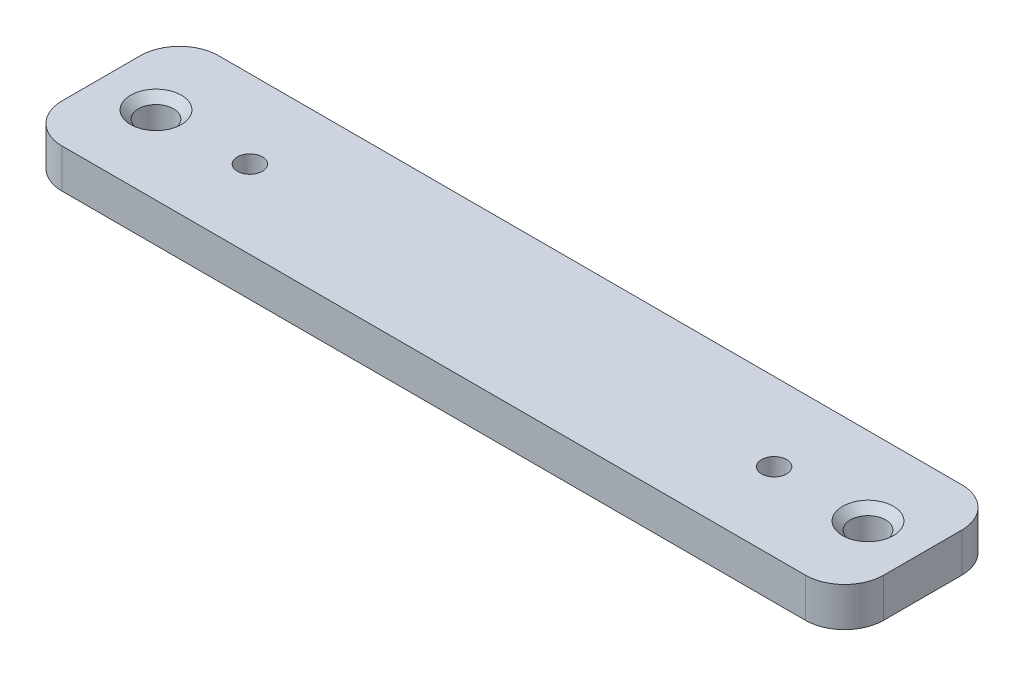
ISO-10303-21;
HEADER;
FILE_DESCRIPTION(('STEP AP214'),'2;1');
FILE_NAME('part.step','',(''),(''),'','','');
FILE_SCHEMA(('AUTOMOTIVE_DESIGN { 1 0 10303 214 1 1 1 1 }'));
ENDSEC;
DATA;
#1=APPLICATION_CONTEXT('core data for automotive mechanical design processes');
#2=APPLICATION_PROTOCOL_DEFINITION('international standard','automotive_design',2000,#1);
#3=PRODUCT_CONTEXT('',#1,'mechanical');
#4=PRODUCT('Part','Part','',(#3));
#5=PRODUCT_RELATED_PRODUCT_CATEGORY('part','',(#4));
#6=PRODUCT_DEFINITION_FORMATION('','',#4);
#7=PRODUCT_DEFINITION_CONTEXT('part definition',#1,'design');
#8=PRODUCT_DEFINITION('design','',#6,#7);
#9=PRODUCT_DEFINITION_SHAPE('','',#8);
#10=(LENGTH_UNIT() NAMED_UNIT(*) SI_UNIT(.MILLI.,.METRE.));
#11=(NAMED_UNIT(*) PLANE_ANGLE_UNIT() SI_UNIT($,.RADIAN.));
#12=(NAMED_UNIT(*) SI_UNIT($,.STERADIAN.) SOLID_ANGLE_UNIT());
#13=UNCERTAINTY_MEASURE_WITH_UNIT(LENGTH_MEASURE(1.E-05),#10,'distance_accuracy_value','');
#14=(GEOMETRIC_REPRESENTATION_CONTEXT(3) GLOBAL_UNCERTAINTY_ASSIGNED_CONTEXT((#13)) GLOBAL_UNIT_ASSIGNED_CONTEXT((#10,
#11,#12)) REPRESENTATION_CONTEXT('',''));
#15=CARTESIAN_POINT('',(0.,0.,0.));
#16=DIRECTION('',(0.,0.,1.));
#17=DIRECTION('',(1.,0.,0.));
#18=AXIS2_PLACEMENT_3D('',#15,#16,#17);
#19=CARTESIAN_POINT('',(0.,5.,0.));
#20=DIRECTION('',(0.,-1.,0.));
#21=DIRECTION('',(0.,0.,-1.));
#22=AXIS2_PLACEMENT_3D('',#19,#20,#21);
#23=PLANE('',#22);
#24=CARTESIAN_POINT('',(98.,5.,-10.));
#25=DIRECTION('',(0.,-1.,0.));
#26=DIRECTION('',(0.,0.,-1.));
#27=AXIS2_PLACEMENT_3D('',#24,#25,#26);
#28=CIRCLE('',#27,3.25);
#29=CARTESIAN_POINT('',(98.,5.,-13.25));
#30=VERTEX_POINT('',#29);
#31=EDGE_CURVE('E177',#30,#30,#28,.T.);
#32=ORIENTED_EDGE('',*,*,#31,.T.);
#33=EDGE_LOOP('',(#32));
#34=FACE_BOUND('',#33,.T.);
#35=CARTESIAN_POINT('',(7.,5.,-10.));
#36=DIRECTION('',(0.,-1.,0.));
#37=DIRECTION('',(0.,0.,-1.));
#38=AXIS2_PLACEMENT_3D('',#35,#36,#37);
#39=CIRCLE('',#38,3.25);
#40=CARTESIAN_POINT('',(7.,5.,-13.25));
#41=VERTEX_POINT('',#40);
#42=EDGE_CURVE('E174',#41,#41,#39,.T.);
#43=ORIENTED_EDGE('',*,*,#42,.T.);
#44=EDGE_LOOP('',(#43));
#45=FACE_BOUND('',#44,.T.);
#46=DIRECTION('',(-1.,0.,0.));
#47=VECTOR('',#46,1.);
#48=CARTESIAN_POINT('',(0.,5.,-20.));
#49=LINE('',#48,#47);
#50=CARTESIAN_POINT('',(100.,5.,-20.));
#51=VERTEX_POINT('',#50);
#52=CARTESIAN_POINT('',(5.,5.,-20.));
#53=VERTEX_POINT('',#52);
#54=EDGE_CURVE('E141',#51,#53,#49,.T.);
#55=ORIENTED_EDGE('',*,*,#54,.T.);
#56=CARTESIAN_POINT('',(5.,5.,-15.));
#57=DIRECTION('',(0.,-1.,0.));
#58=DIRECTION('',(0.,0.,-1.));
#59=AXIS2_PLACEMENT_3D('',#56,#57,#58);
#60=CIRCLE('',#59,5.);
#61=CARTESIAN_POINT('',(0.,5.,-15.));
#62=VERTEX_POINT('',#61);
#63=EDGE_CURVE('E160',#53,#62,#60,.F.);
#64=ORIENTED_EDGE('',*,*,#63,.T.);
#65=DIRECTION('',(0.,0.,1.));
#66=VECTOR('',#65,1.);
#67=CARTESIAN_POINT('',(0.,5.,0.));
#68=LINE('',#67,#66);
#69=CARTESIAN_POINT('',(0.,5.,-5.));
#70=VERTEX_POINT('',#69);
#71=EDGE_CURVE('E124',#62,#70,#68,.T.);
#72=ORIENTED_EDGE('',*,*,#71,.T.);
#73=CARTESIAN_POINT('',(5.,5.,-5.));
#74=DIRECTION('',(0.,-1.,0.));
#75=DIRECTION('',(0.,0.,-1.));
#76=AXIS2_PLACEMENT_3D('',#73,#74,#75);
#77=CIRCLE('',#76,5.);
#78=CARTESIAN_POINT('',(5.,5.,0.));
#79=VERTEX_POINT('',#78);
#80=EDGE_CURVE('E158',#70,#79,#77,.F.);
#81=ORIENTED_EDGE('',*,*,#80,.T.);
#82=DIRECTION('',(1.,0.,0.));
#83=VECTOR('',#82,1.);
#84=CARTESIAN_POINT('',(0.,5.,0.));
#85=LINE('',#84,#83);
#86=CARTESIAN_POINT('',(100.,5.,0.));
#87=VERTEX_POINT('',#86);
#88=EDGE_CURVE('E217',#79,#87,#85,.T.);
#89=ORIENTED_EDGE('',*,*,#88,.T.);
#90=CARTESIAN_POINT('',(100.,5.,-5.));
#91=DIRECTION('',(0.,-1.,0.));
#92=DIRECTION('',(0.,0.,-1.));
#93=AXIS2_PLACEMENT_3D('',#90,#91,#92);
#94=CIRCLE('',#93,5.);
#95=CARTESIAN_POINT('',(105.,5.,-5.));
#96=VERTEX_POINT('',#95);
#97=EDGE_CURVE('E59',#87,#96,#94,.F.);
#98=ORIENTED_EDGE('',*,*,#97,.T.);
#99=DIRECTION('',(0.,0.,-1.));
#100=VECTOR('',#99,1.);
#101=CARTESIAN_POINT('',(105.,5.,0.));
#102=LINE('',#101,#100);
#103=CARTESIAN_POINT('',(105.,5.,-15.));
#104=VERTEX_POINT('',#103);
#105=EDGE_CURVE('E218',#96,#104,#102,.T.);
#106=ORIENTED_EDGE('',*,*,#105,.T.);
#107=CARTESIAN_POINT('',(100.,5.,-15.));
#108=DIRECTION('',(0.,-1.,0.));
#109=DIRECTION('',(0.,0.,-1.));
#110=AXIS2_PLACEMENT_3D('',#107,#108,#109);
#111=CIRCLE('',#110,5.);
#112=EDGE_CURVE('E156',#104,#51,#111,.F.);
#113=ORIENTED_EDGE('',*,*,#112,.T.);
#114=EDGE_LOOP('',(#55,#64,#72,#81,#89,#98,#106,#113));
#115=FACE_BOUND('',#114,.T.);
#116=CARTESIAN_POINT('',(19.,5.,-10.));
#117=DIRECTION('',(0.,1.,0.));
#118=DIRECTION('',(0.,0.,1.));
#119=AXIS2_PLACEMENT_3D('',#116,#117,#118);
#120=CIRCLE('',#119,1.6);
#121=CARTESIAN_POINT('',(19.,5.,-8.4));
#122=VERTEX_POINT('',#121);
#123=EDGE_CURVE('E132',#122,#122,#120,.T.);
#124=ORIENTED_EDGE('',*,*,#123,.F.);
#125=EDGE_LOOP('',(#124));
#126=FACE_BOUND('',#125,.T.);
#127=CARTESIAN_POINT('',(86.,5.,-10.));
#128=DIRECTION('',(0.,1.,0.));
#129=DIRECTION('',(0.,0.,1.));
#130=AXIS2_PLACEMENT_3D('',#127,#128,#129);
#131=CIRCLE('',#130,1.6);
#132=CARTESIAN_POINT('',(86.,5.,-8.4));
#133=VERTEX_POINT('',#132);
#134=EDGE_CURVE('E138',#133,#133,#131,.T.);
#135=ORIENTED_EDGE('',*,*,#134,.F.);
#136=EDGE_LOOP('',(#135));
#137=FACE_BOUND('',#136,.T.);
#138=ADVANCED_FACE('F37',(#34,#45,#115,#126,#137),#23,.F.);
#139=CARTESIAN_POINT('',(0.,0.,0.));
#140=DIRECTION('',(0.,-1.,0.));
#141=DIRECTION('',(0.,0.,-1.));
#142=AXIS2_PLACEMENT_3D('',#139,#140,#141);
#143=PLANE('',#142);
#144=CARTESIAN_POINT('',(86.,0.,-10.));
#145=DIRECTION('',(0.,-1.,0.));
#146=DIRECTION('',(0.,0.,-1.));
#147=AXIS2_PLACEMENT_3D('',#144,#145,#146);
#148=CIRCLE('',#147,2.60000000000002);
#149=CARTESIAN_POINT('',(86.,0.,-12.6));
#150=VERTEX_POINT('',#149);
#151=EDGE_CURVE('E186',#150,#150,#148,.F.);
#152=ORIENTED_EDGE('',*,*,#151,.T.);
#153=EDGE_LOOP('',(#152));
#154=FACE_BOUND('',#153,.T.);
#155=CARTESIAN_POINT('',(19.,0.,-10.));
#156=DIRECTION('',(0.,-1.,0.));
#157=DIRECTION('',(0.,0.,-1.));
#158=AXIS2_PLACEMENT_3D('',#155,#156,#157);
#159=CIRCLE('',#158,2.60000000000002);
#160=CARTESIAN_POINT('',(19.,0.,-12.6));
#161=VERTEX_POINT('',#160);
#162=EDGE_CURVE('E183',#161,#161,#159,.F.);
#163=ORIENTED_EDGE('',*,*,#162,.T.);
#164=EDGE_LOOP('',(#163));
#165=FACE_BOUND('',#164,.T.);
#166=CARTESIAN_POINT('',(7.,0.,-10.));
#167=DIRECTION('',(0.,1.,0.));
#168=DIRECTION('',(0.,0.,1.));
#169=AXIS2_PLACEMENT_3D('',#166,#167,#168);
#170=CIRCLE('',#169,2.25);
#171=CARTESIAN_POINT('',(7.,0.,-7.75));
#172=VERTEX_POINT('',#171);
#173=EDGE_CURVE('E207',#172,#172,#170,.T.);
#174=ORIENTED_EDGE('',*,*,#173,.T.);
#175=EDGE_LOOP('',(#174));
#176=FACE_BOUND('',#175,.T.);
#177=DIRECTION('',(0.,0.,1.));
#178=VECTOR('',#177,1.);
#179=CARTESIAN_POINT('',(0.,0.,0.));
#180=LINE('',#179,#178);
#181=CARTESIAN_POINT('',(0.,0.,-15.));
#182=VERTEX_POINT('',#181);
#183=CARTESIAN_POINT('',(0.,0.,-5.));
#184=VERTEX_POINT('',#183);
#185=EDGE_CURVE('E121',#182,#184,#180,.T.);
#186=ORIENTED_EDGE('',*,*,#185,.F.);
#187=CARTESIAN_POINT('',(5.,0.,-15.));
#188=DIRECTION('',(0.,-1.,0.));
#189=DIRECTION('',(0.,0.,-1.));
#190=AXIS2_PLACEMENT_3D('',#187,#188,#189);
#191=CIRCLE('',#190,5.);
#192=CARTESIAN_POINT('',(5.,0.,-20.));
#193=VERTEX_POINT('',#192);
#194=EDGE_CURVE('E104',#182,#193,#191,.T.);
#195=ORIENTED_EDGE('',*,*,#194,.T.);
#196=DIRECTION('',(-1.,0.,0.));
#197=VECTOR('',#196,1.);
#198=CARTESIAN_POINT('',(0.,0.,-20.));
#199=LINE('',#198,#197);
#200=CARTESIAN_POINT('',(100.,0.,-20.));
#201=VERTEX_POINT('',#200);
#202=EDGE_CURVE('E145',#201,#193,#199,.T.);
#203=ORIENTED_EDGE('',*,*,#202,.F.);
#204=CARTESIAN_POINT('',(100.,0.,-15.));
#205=DIRECTION('',(0.,-1.,0.));
#206=DIRECTION('',(0.,0.,-1.));
#207=AXIS2_PLACEMENT_3D('',#204,#205,#206);
#208=CIRCLE('',#207,5.);
#209=CARTESIAN_POINT('',(105.,0.,-15.));
#210=VERTEX_POINT('',#209);
#211=EDGE_CURVE('E149',#201,#210,#208,.T.);
#212=ORIENTED_EDGE('',*,*,#211,.T.);
#213=DIRECTION('',(0.,0.,-1.));
#214=VECTOR('',#213,1.);
#215=CARTESIAN_POINT('',(105.,0.,0.));
#216=LINE('',#215,#214);
#217=CARTESIAN_POINT('',(105.,0.,-5.));
#218=VERTEX_POINT('',#217);
#219=EDGE_CURVE('E135',#218,#210,#216,.T.);
#220=ORIENTED_EDGE('',*,*,#219,.F.);
#221=CARTESIAN_POINT('',(100.,0.,-5.));
#222=DIRECTION('',(0.,-1.,0.));
#223=DIRECTION('',(0.,0.,-1.));
#224=AXIS2_PLACEMENT_3D('',#221,#222,#223);
#225=CIRCLE('',#224,5.);
#226=CARTESIAN_POINT('',(100.,0.,0.));
#227=VERTEX_POINT('',#226);
#228=EDGE_CURVE('E125',#218,#227,#225,.T.);
#229=ORIENTED_EDGE('',*,*,#228,.T.);
#230=DIRECTION('',(1.,0.,0.));
#231=VECTOR('',#230,1.);
#232=CARTESIAN_POINT('',(0.,0.,0.));
#233=LINE('',#232,#231);
#234=CARTESIAN_POINT('',(5.,0.,0.));
#235=VERTEX_POINT('',#234);
#236=EDGE_CURVE('E131',#235,#227,#233,.T.);
#237=ORIENTED_EDGE('',*,*,#236,.F.);
#238=CARTESIAN_POINT('',(5.,0.,-5.));
#239=DIRECTION('',(0.,-1.,0.));
#240=DIRECTION('',(0.,0.,-1.));
#241=AXIS2_PLACEMENT_3D('',#238,#239,#240);
#242=CIRCLE('',#241,5.);
#243=EDGE_CURVE('E115',#235,#184,#242,.T.);
#244=ORIENTED_EDGE('',*,*,#243,.T.);
#245=EDGE_LOOP('',(#186,#195,#203,#212,#220,#229,#237,#244));
#246=FACE_BOUND('',#245,.T.);
#247=CARTESIAN_POINT('',(98.,0.,-10.));
#248=DIRECTION('',(0.,1.,0.));
#249=DIRECTION('',(0.,0.,1.));
#250=AXIS2_PLACEMENT_3D('',#247,#248,#249);
#251=CIRCLE('',#250,2.25);
#252=CARTESIAN_POINT('',(98.,0.,-7.75));
#253=VERTEX_POINT('',#252);
#254=EDGE_CURVE('E209',#253,#253,#251,.T.);
#255=ORIENTED_EDGE('',*,*,#254,.T.);
#256=EDGE_LOOP('',(#255));
#257=FACE_BOUND('',#256,.T.);
#258=ADVANCED_FACE('F128',(#154,#165,#176,#246,#257),#143,.T.);
#259=CARTESIAN_POINT('',(0.,5.,0.));
#260=DIRECTION('',(1.,0.,0.));
#261=DIRECTION('',(0.,0.,-1.));
#262=AXIS2_PLACEMENT_3D('',#259,#260,#261);
#263=PLANE('',#262);
#264=ORIENTED_EDGE('',*,*,#71,.F.);
#265=DIRECTION('',(0.,-1.,0.));
#266=VECTOR('',#265,1.);
#267=CARTESIAN_POINT('',(0.,5.,-15.));
#268=LINE('',#267,#266);
#269=EDGE_CURVE('E108',#62,#182,#268,.T.);
#270=ORIENTED_EDGE('',*,*,#269,.T.);
#271=ORIENTED_EDGE('',*,*,#185,.T.);
#272=DIRECTION('',(0.,-1.,0.));
#273=VECTOR('',#272,1.);
#274=CARTESIAN_POINT('',(0.,5.,-5.));
#275=LINE('',#274,#273);
#276=EDGE_CURVE('E126',#184,#70,#275,.F.);
#277=ORIENTED_EDGE('',*,*,#276,.T.);
#278=EDGE_LOOP('',(#264,#270,#271,#277));
#279=FACE_BOUND('',#278,.T.);
#280=ADVANCED_FACE('F120',(#279),#263,.F.);
#281=CARTESIAN_POINT('',(0.,5.,0.));
#282=DIRECTION('',(0.,0.,-1.));
#283=DIRECTION('',(-1.,0.,0.));
#284=AXIS2_PLACEMENT_3D('',#281,#282,#283);
#285=PLANE('',#284);
#286=ORIENTED_EDGE('',*,*,#88,.F.);
#287=DIRECTION('',(0.,-1.,0.));
#288=VECTOR('',#287,1.);
#289=CARTESIAN_POINT('',(5.,5.,0.));
#290=LINE('',#289,#288);
#291=EDGE_CURVE('E164',#79,#235,#290,.T.);
#292=ORIENTED_EDGE('',*,*,#291,.T.);
#293=ORIENTED_EDGE('',*,*,#236,.T.);
#294=DIRECTION('',(0.,-1.,0.));
#295=VECTOR('',#294,1.);
#296=CARTESIAN_POINT('',(100.,5.,0.));
#297=LINE('',#296,#295);
#298=EDGE_CURVE('E162',#227,#87,#297,.F.);
#299=ORIENTED_EDGE('',*,*,#298,.T.);
#300=EDGE_LOOP('',(#286,#292,#293,#299));
#301=FACE_BOUND('',#300,.T.);
#302=ADVANCED_FACE('F236',(#301),#285,.F.);
#303=CARTESIAN_POINT('',(105.,5.,0.));
#304=DIRECTION('',(-1.,0.,0.));
#305=DIRECTION('',(0.,0.,1.));
#306=AXIS2_PLACEMENT_3D('',#303,#304,#305);
#307=PLANE('',#306);
#308=ORIENTED_EDGE('',*,*,#219,.T.);
#309=DIRECTION('',(0.,-1.,0.));
#310=VECTOR('',#309,1.);
#311=CARTESIAN_POINT('',(105.,5.,-15.));
#312=LINE('',#311,#310);
#313=EDGE_CURVE('E52',#210,#104,#312,.F.);
#314=ORIENTED_EDGE('',*,*,#313,.T.);
#315=ORIENTED_EDGE('',*,*,#105,.F.);
#316=DIRECTION('',(0.,-1.,0.));
#317=VECTOR('',#316,1.);
#318=CARTESIAN_POINT('',(105.,5.,-5.));
#319=LINE('',#318,#317);
#320=EDGE_CURVE('E167',#96,#218,#319,.T.);
#321=ORIENTED_EDGE('',*,*,#320,.T.);
#322=EDGE_LOOP('',(#308,#314,#315,#321));
#323=FACE_BOUND('',#322,.T.);
#324=ADVANCED_FACE('F229',(#323),#307,.F.);
#325=CARTESIAN_POINT('',(0.,5.,-20.));
#326=DIRECTION('',(0.,0.,1.));
#327=DIRECTION('',(1.,0.,0.));
#328=AXIS2_PLACEMENT_3D('',#325,#326,#327);
#329=PLANE('',#328);
#330=ORIENTED_EDGE('',*,*,#202,.T.);
#331=DIRECTION('',(0.,-1.,0.));
#332=VECTOR('',#331,1.);
#333=CARTESIAN_POINT('',(5.,5.,-20.));
#334=LINE('',#333,#332);
#335=EDGE_CURVE('E109',#193,#53,#334,.F.);
#336=ORIENTED_EDGE('',*,*,#335,.T.);
#337=ORIENTED_EDGE('',*,*,#54,.F.);
#338=DIRECTION('',(0.,-1.,0.));
#339=VECTOR('',#338,1.);
#340=CARTESIAN_POINT('',(100.,5.,-20.));
#341=LINE('',#340,#339);
#342=EDGE_CURVE('E114',#51,#201,#341,.T.);
#343=ORIENTED_EDGE('',*,*,#342,.T.);
#344=EDGE_LOOP('',(#330,#336,#337,#343));
#345=FACE_BOUND('',#344,.T.);
#346=ADVANCED_FACE('F225',(#345),#329,.F.);
#347=CARTESIAN_POINT('',(19.,5.,-10.));
#348=DIRECTION('',(0.,-1.,0.));
#349=DIRECTION('',(0.,0.,-1.));
#350=AXIS2_PLACEMENT_3D('',#347,#348,#349);
#351=CYLINDRICAL_SURFACE('',#350,1.6);
#352=CARTESIAN_POINT('',(19.,1.00000000000001,-10.));
#353=DIRECTION('',(0.,-1.,0.));
#354=DIRECTION('',(0.,0.,-1.));
#355=AXIS2_PLACEMENT_3D('',#352,#353,#354);
#356=CIRCLE('',#355,1.6);
#357=CARTESIAN_POINT('',(19.,1.00000000000001,-11.6));
#358=VERTEX_POINT('',#357);
#359=EDGE_CURVE('E11',#358,#358,#356,.T.);
#360=ORIENTED_EDGE('',*,*,#359,.T.);
#361=EDGE_LOOP('',(#360));
#362=FACE_BOUND('',#361,.T.);
#363=ORIENTED_EDGE('',*,*,#123,.T.);
#364=EDGE_LOOP('',(#363));
#365=FACE_BOUND('',#364,.T.);
#366=ADVANCED_FACE('F257',(#362,#365),#351,.F.);
#367=CARTESIAN_POINT('',(86.,5.,-10.));
#368=DIRECTION('',(0.,-1.,0.));
#369=DIRECTION('',(0.,0.,-1.));
#370=AXIS2_PLACEMENT_3D('',#367,#368,#369);
#371=CYLINDRICAL_SURFACE('',#370,1.6);
#372=CARTESIAN_POINT('',(86.,1.00000000000001,-10.));
#373=DIRECTION('',(0.,-1.,0.));
#374=DIRECTION('',(0.,0.,-1.));
#375=AXIS2_PLACEMENT_3D('',#372,#373,#374);
#376=CIRCLE('',#375,1.6);
#377=CARTESIAN_POINT('',(86.,1.00000000000001,-11.6));
#378=VERTEX_POINT('',#377);
#379=EDGE_CURVE('E45',#378,#378,#376,.T.);
#380=ORIENTED_EDGE('',*,*,#379,.T.);
#381=EDGE_LOOP('',(#380));
#382=FACE_BOUND('',#381,.T.);
#383=ORIENTED_EDGE('',*,*,#134,.T.);
#384=EDGE_LOOP('',(#383));
#385=FACE_BOUND('',#384,.T.);
#386=ADVANCED_FACE('F191',(#382,#385),#371,.F.);
#387=CARTESIAN_POINT('',(7.,5.,-10.));
#388=DIRECTION('',(0.,-1.,0.));
#389=DIRECTION('',(0.,0.,-1.));
#390=AXIS2_PLACEMENT_3D('',#387,#388,#389);
#391=CYLINDRICAL_SURFACE('',#390,2.25);
#392=CARTESIAN_POINT('',(7.,4.,-10.));
#393=DIRECTION('',(0.,-1.,0.));
#394=DIRECTION('',(0.,0.,-1.));
#395=AXIS2_PLACEMENT_3D('',#392,#393,#394);
#396=CIRCLE('',#395,2.25);
#397=CARTESIAN_POINT('',(7.,4.,-12.25));
#398=VERTEX_POINT('',#397);
#399=EDGE_CURVE('E180',#398,#398,#396,.F.);
#400=ORIENTED_EDGE('',*,*,#399,.T.);
#401=EDGE_LOOP('',(#400));
#402=FACE_BOUND('',#401,.T.);
#403=ORIENTED_EDGE('',*,*,#173,.F.);
#404=EDGE_LOOP('',(#403));
#405=FACE_BOUND('',#404,.T.);
#406=ADVANCED_FACE('F296',(#402,#405),#391,.F.);
#407=CARTESIAN_POINT('',(98.,5.,-10.));
#408=DIRECTION('',(0.,-1.,0.));
#409=DIRECTION('',(0.,0.,-1.));
#410=AXIS2_PLACEMENT_3D('',#407,#408,#409);
#411=CYLINDRICAL_SURFACE('',#410,2.25);
#412=CARTESIAN_POINT('',(98.,4.,-10.));
#413=DIRECTION('',(0.,-1.,0.));
#414=DIRECTION('',(0.,0.,-1.));
#415=AXIS2_PLACEMENT_3D('',#412,#413,#414);
#416=CIRCLE('',#415,2.25);
#417=CARTESIAN_POINT('',(98.,4.,-12.25));
#418=VERTEX_POINT('',#417);
#419=EDGE_CURVE('E171',#418,#418,#416,.F.);
#420=ORIENTED_EDGE('',*,*,#419,.T.);
#421=EDGE_LOOP('',(#420));
#422=FACE_BOUND('',#421,.T.);
#423=ORIENTED_EDGE('',*,*,#254,.F.);
#424=EDGE_LOOP('',(#423));
#425=FACE_BOUND('',#424,.T.);
#426=ADVANCED_FACE('F248',(#422,#425),#411,.F.);
#427=CARTESIAN_POINT('',(5.,5.,-15.));
#428=DIRECTION('',(0.,-1.,0.));
#429=DIRECTION('',(0.,0.,-1.));
#430=AXIS2_PLACEMENT_3D('',#427,#428,#429);
#431=CYLINDRICAL_SURFACE('',#430,5.);
#432=ORIENTED_EDGE('',*,*,#63,.F.);
#433=ORIENTED_EDGE('',*,*,#335,.F.);
#434=ORIENTED_EDGE('',*,*,#194,.F.);
#435=ORIENTED_EDGE('',*,*,#269,.F.);
#436=EDGE_LOOP('',(#432,#433,#434,#435));
#437=FACE_BOUND('',#436,.T.);
#438=ADVANCED_FACE('F107',(#437),#431,.T.);
#439=CARTESIAN_POINT('',(5.,5.,-5.));
#440=DIRECTION('',(0.,-1.,0.));
#441=DIRECTION('',(0.,0.,-1.));
#442=AXIS2_PLACEMENT_3D('',#439,#440,#441);
#443=CYLINDRICAL_SURFACE('',#442,5.);
#444=ORIENTED_EDGE('',*,*,#80,.F.);
#445=ORIENTED_EDGE('',*,*,#276,.F.);
#446=ORIENTED_EDGE('',*,*,#243,.F.);
#447=ORIENTED_EDGE('',*,*,#291,.F.);
#448=EDGE_LOOP('',(#444,#445,#446,#447));
#449=FACE_BOUND('',#448,.T.);
#450=ADVANCED_FACE('F240',(#449),#443,.T.);
#451=CARTESIAN_POINT('',(100.,5.,-15.));
#452=DIRECTION('',(0.,-1.,0.));
#453=DIRECTION('',(0.,0.,-1.));
#454=AXIS2_PLACEMENT_3D('',#451,#452,#453);
#455=CYLINDRICAL_SURFACE('',#454,5.);
#456=ORIENTED_EDGE('',*,*,#112,.F.);
#457=ORIENTED_EDGE('',*,*,#313,.F.);
#458=ORIENTED_EDGE('',*,*,#211,.F.);
#459=ORIENTED_EDGE('',*,*,#342,.F.);
#460=EDGE_LOOP('',(#456,#457,#458,#459));
#461=FACE_BOUND('',#460,.T.);
#462=ADVANCED_FACE('F227',(#461),#455,.T.);
#463=CARTESIAN_POINT('',(100.,5.,-5.));
#464=DIRECTION('',(0.,-1.,0.));
#465=DIRECTION('',(0.,0.,-1.));
#466=AXIS2_PLACEMENT_3D('',#463,#464,#465);
#467=CYLINDRICAL_SURFACE('',#466,5.);
#468=ORIENTED_EDGE('',*,*,#97,.F.);
#469=ORIENTED_EDGE('',*,*,#298,.F.);
#470=ORIENTED_EDGE('',*,*,#228,.F.);
#471=ORIENTED_EDGE('',*,*,#320,.F.);
#472=EDGE_LOOP('',(#468,#469,#470,#471));
#473=FACE_BOUND('',#472,.T.);
#474=ADVANCED_FACE('F232',(#473),#467,.T.);
#475=CARTESIAN_POINT('',(98.,4.,-10.));
#476=DIRECTION('',(0.,1.,0.));
#477=DIRECTION('',(0.,0.,1.));
#478=AXIS2_PLACEMENT_3D('',#475,#476,#477);
#479=CONICAL_SURFACE('',#478,2.25,0.785398163397452);
#480=ORIENTED_EDGE('',*,*,#31,.F.);
#481=EDGE_LOOP('',(#480));
#482=FACE_BOUND('',#481,.T.);
#483=ORIENTED_EDGE('',*,*,#419,.F.);
#484=EDGE_LOOP('',(#483));
#485=FACE_BOUND('',#484,.T.);
#486=ADVANCED_FACE('F333',(#482,#485),#479,.F.);
#487=CARTESIAN_POINT('',(7.,4.,-10.));
#488=DIRECTION('',(0.,1.,0.));
#489=DIRECTION('',(0.,0.,1.));
#490=AXIS2_PLACEMENT_3D('',#487,#488,#489);
#491=CONICAL_SURFACE('',#490,2.25,0.785398163397451);
#492=ORIENTED_EDGE('',*,*,#42,.F.);
#493=EDGE_LOOP('',(#492));
#494=FACE_BOUND('',#493,.T.);
#495=ORIENTED_EDGE('',*,*,#399,.F.);
#496=EDGE_LOOP('',(#495));
#497=FACE_BOUND('',#496,.T.);
#498=ADVANCED_FACE('F197',(#494,#497),#491,.F.);
#499=CARTESIAN_POINT('',(86.,0.,-10.));
#500=DIRECTION('',(0.,-1.,0.));
#501=DIRECTION('',(0.,0.,-1.));
#502=AXIS2_PLACEMENT_3D('',#499,#500,#501);
#503=CONICAL_SURFACE('',#502,2.60000000000002,0.785398163397452);
#504=ORIENTED_EDGE('',*,*,#379,.F.);
#505=EDGE_LOOP('',(#504));
#506=FACE_BOUND('',#505,.T.);
#507=ORIENTED_EDGE('',*,*,#151,.F.);
#508=EDGE_LOOP('',(#507));
#509=FACE_BOUND('',#508,.T.);
#510=ADVANCED_FACE('F194',(#506,#509),#503,.F.);
#511=CARTESIAN_POINT('',(19.,0.,-10.));
#512=DIRECTION('',(0.,-1.,0.));
#513=DIRECTION('',(0.,0.,-1.));
#514=AXIS2_PLACEMENT_3D('',#511,#512,#513);
#515=CONICAL_SURFACE('',#514,2.60000000000002,0.785398163397452);
#516=ORIENTED_EDGE('',*,*,#359,.F.);
#517=EDGE_LOOP('',(#516));
#518=FACE_BOUND('',#517,.T.);
#519=ORIENTED_EDGE('',*,*,#162,.F.);
#520=EDGE_LOOP('',(#519));
#521=FACE_BOUND('',#520,.T.);
#522=ADVANCED_FACE('F39',(#518,#521),#515,.F.);
#523=CLOSED_SHELL('',(#138,#258,#280,#302,#324,#346,#366,#386,#406,#426,#438,#450,#462,#474,
#486,#498,#510,#522));
#524=MANIFOLD_SOLID_BREP('B2',#523);
#525=ADVANCED_BREP_SHAPE_REPRESENTATION('',(#18,#524),#14);
#526=SHAPE_DEFINITION_REPRESENTATION(#9,#525);
ENDSEC;
END-ISO-10303-21;
